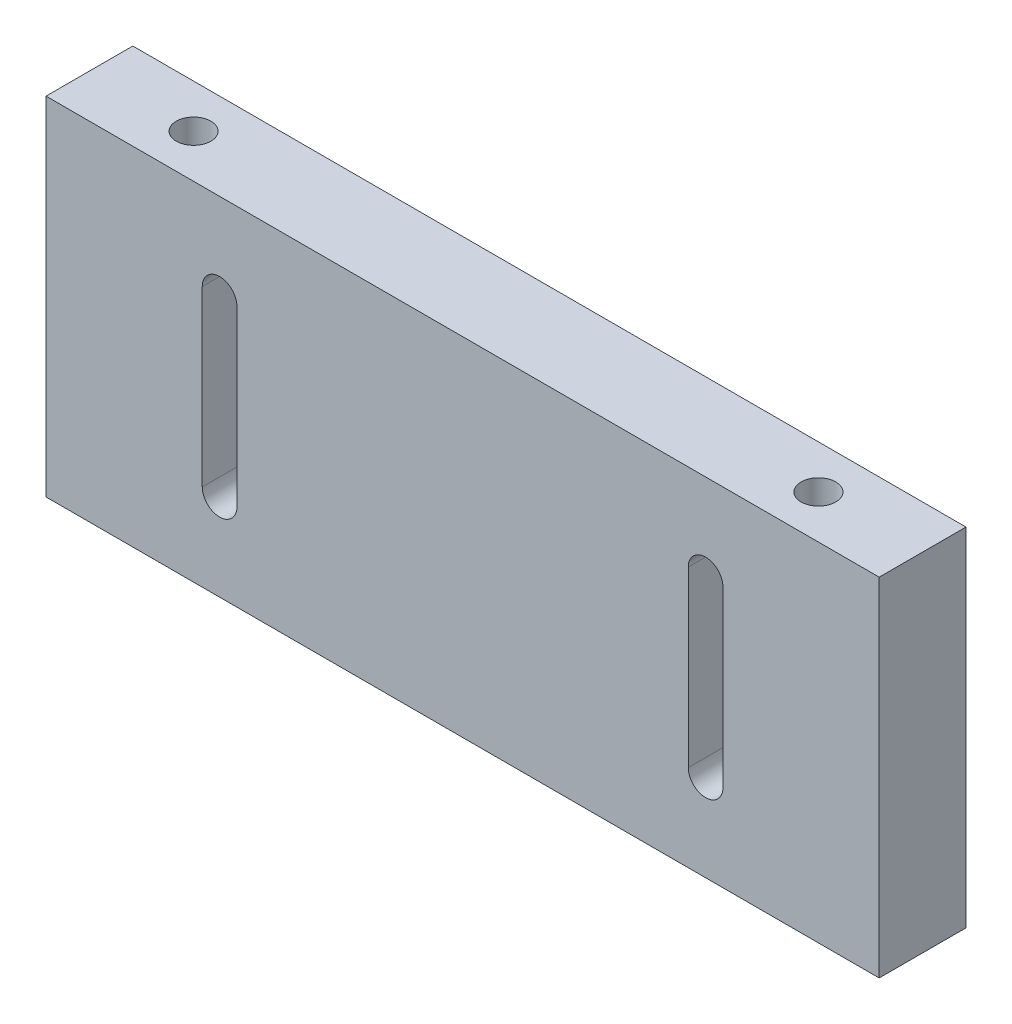
ISO-10303-21;
HEADER;
FILE_DESCRIPTION(('STEP AP214'),'2;1');
FILE_NAME('part.step','',(''),(''),'','','');
FILE_SCHEMA(('AUTOMOTIVE_DESIGN { 1 0 10303 214 1 1 1 1 }'));
ENDSEC;
DATA;
#1=APPLICATION_CONTEXT('core data for automotive mechanical design processes');
#2=APPLICATION_PROTOCOL_DEFINITION('international standard','automotive_design',2000,#1);
#3=PRODUCT_CONTEXT('',#1,'mechanical');
#4=PRODUCT('Part','Part','',(#3));
#5=PRODUCT_RELATED_PRODUCT_CATEGORY('part','',(#4));
#6=PRODUCT_DEFINITION_FORMATION('','',#4);
#7=PRODUCT_DEFINITION_CONTEXT('part definition',#1,'design');
#8=PRODUCT_DEFINITION('design','',#6,#7);
#9=PRODUCT_DEFINITION_SHAPE('','',#8);
#10=(LENGTH_UNIT() NAMED_UNIT(*) SI_UNIT(.MILLI.,.METRE.));
#11=(NAMED_UNIT(*) PLANE_ANGLE_UNIT() SI_UNIT($,.RADIAN.));
#12=(NAMED_UNIT(*) SI_UNIT($,.STERADIAN.) SOLID_ANGLE_UNIT());
#13=UNCERTAINTY_MEASURE_WITH_UNIT(LENGTH_MEASURE(1.E-05),#10,'distance_accuracy_value','');
#14=(GEOMETRIC_REPRESENTATION_CONTEXT(3) GLOBAL_UNCERTAINTY_ASSIGNED_CONTEXT((#13)) GLOBAL_UNIT_ASSIGNED_CONTEXT((#10,
#11,#12)) REPRESENTATION_CONTEXT('',''));
#15=CARTESIAN_POINT('',(0.,0.,0.));
#16=DIRECTION('',(0.,0.,1.));
#17=DIRECTION('',(1.,0.,0.));
#18=AXIS2_PLACEMENT_3D('',#15,#16,#17);
#19=CARTESIAN_POINT('',(-120.,-100.,-9.72222222222218));
#20=DIRECTION('',(-1.,0.,0.));
#21=DIRECTION('',(0.,0.,1.));
#22=AXIS2_PLACEMENT_3D('',#19,#20,#21);
#23=PLANE('',#22);
#24=DIRECTION('',(0.,0.,1.));
#25=VECTOR('',#24,1.);
#26=CARTESIAN_POINT('',(-120.,0.,-9.72222222222218));
#27=LINE('',#26,#25);
#28=CARTESIAN_POINT('',(-120.,0.,-9.72222222222218));
#29=VERTEX_POINT('',#28);
#30=CARTESIAN_POINT('',(-120.,0.,15.2777777777778));
#31=VERTEX_POINT('',#30);
#32=EDGE_CURVE('E212',#29,#31,#27,.T.);
#33=ORIENTED_EDGE('',*,*,#32,.F.);
#34=DIRECTION('',(0.,1.,0.));
#35=VECTOR('',#34,1.);
#36=CARTESIAN_POINT('',(-120.,-100.,-9.72222222222218));
#37=LINE('',#36,#35);
#38=CARTESIAN_POINT('',(-120.,-100.,-9.72222222222218));
#39=VERTEX_POINT('',#38);
#40=EDGE_CURVE('E13',#39,#29,#37,.T.);
#41=ORIENTED_EDGE('',*,*,#40,.F.);
#42=DIRECTION('',(0.,0.,1.));
#43=VECTOR('',#42,1.);
#44=CARTESIAN_POINT('',(-120.,-100.,-9.72222222222218));
#45=LINE('',#44,#43);
#46=CARTESIAN_POINT('',(-120.,-100.,15.2777777777778));
#47=VERTEX_POINT('',#46);
#48=EDGE_CURVE('E215',#39,#47,#45,.T.);
#49=ORIENTED_EDGE('',*,*,#48,.T.);
#50=DIRECTION('',(0.,1.,0.));
#51=VECTOR('',#50,1.);
#52=CARTESIAN_POINT('',(-120.,-100.,15.2777777777778));
#53=LINE('',#52,#51);
#54=EDGE_CURVE('E48',#47,#31,#53,.T.);
#55=ORIENTED_EDGE('',*,*,#54,.T.);
#56=EDGE_LOOP('',(#33,#41,#49,#55));
#57=FACE_BOUND('',#56,.T.);
#58=ADVANCED_FACE('F45',(#57),#23,.T.);
#59=CARTESIAN_POINT('',(-120.,-100.,-9.72222222222218));
#60=DIRECTION('',(0.,0.,-1.));
#61=DIRECTION('',(-1.,0.,0.));
#62=AXIS2_PLACEMENT_3D('',#59,#60,#61);
#63=PLANE('',#62);
#64=CARTESIAN_POINT('',(70.,-25.,-9.72222222222218));
#65=DIRECTION('',(0.,0.,1.));
#66=DIRECTION('',(1.,0.,0.));
#67=AXIS2_PLACEMENT_3D('',#64,#65,#66);
#68=CIRCLE('',#67,4.99999999999999);
#69=CARTESIAN_POINT('',(75.,-25.,-9.72222222222218));
#70=VERTEX_POINT('',#69);
#71=CARTESIAN_POINT('',(65.,-25.,-9.72222222222218));
#72=VERTEX_POINT('',#71);
#73=EDGE_CURVE('E136',#70,#72,#68,.T.);
#74=ORIENTED_EDGE('',*,*,#73,.T.);
#75=DIRECTION('',(0.,-1.,0.));
#76=VECTOR('',#75,1.);
#77=CARTESIAN_POINT('',(65.,-25.,-9.72222222222218));
#78=LINE('',#77,#76);
#79=CARTESIAN_POINT('',(65.,-75.,-9.72222222222218));
#80=VERTEX_POINT('',#79);
#81=EDGE_CURVE('E145',#72,#80,#78,.T.);
#82=ORIENTED_EDGE('',*,*,#81,.T.);
#83=CARTESIAN_POINT('',(70.,-75.,-9.72222222222218));
#84=DIRECTION('',(0.,0.,1.));
#85=DIRECTION('',(1.,0.,0.));
#86=AXIS2_PLACEMENT_3D('',#83,#84,#85);
#87=CIRCLE('',#86,4.99999999999998);
#88=CARTESIAN_POINT('',(75.,-75.,-9.72222222222218));
#89=VERTEX_POINT('',#88);
#90=EDGE_CURVE('E61',#80,#89,#87,.T.);
#91=ORIENTED_EDGE('',*,*,#90,.T.);
#92=DIRECTION('',(0.,1.,0.));
#93=VECTOR('',#92,1.);
#94=CARTESIAN_POINT('',(75.,-25.,-9.72222222222218));
#95=LINE('',#94,#93);
#96=EDGE_CURVE('E142',#89,#70,#95,.T.);
#97=ORIENTED_EDGE('',*,*,#96,.T.);
#98=EDGE_LOOP('',(#74,#82,#91,#97));
#99=FACE_BOUND('',#98,.T.);
#100=CARTESIAN_POINT('',(-70.,-25.,-9.72222222222218));
#101=DIRECTION('',(0.,0.,1.));
#102=DIRECTION('',(1.,0.,0.));
#103=AXIS2_PLACEMENT_3D('',#100,#101,#102);
#104=CIRCLE('',#103,5.);
#105=CARTESIAN_POINT('',(-65.,-25.,-9.72222222222218));
#106=VERTEX_POINT('',#105);
#107=CARTESIAN_POINT('',(-75.,-25.,-9.72222222222218));
#108=VERTEX_POINT('',#107);
#109=EDGE_CURVE('E171',#106,#108,#104,.T.);
#110=ORIENTED_EDGE('',*,*,#109,.T.);
#111=DIRECTION('',(0.,-1.,0.));
#112=VECTOR('',#111,1.);
#113=CARTESIAN_POINT('',(-75.,-25.,-9.72222222222218));
#114=LINE('',#113,#112);
#115=CARTESIAN_POINT('',(-75.,-75.,-9.72222222222218));
#116=VERTEX_POINT('',#115);
#117=EDGE_CURVE('E174',#108,#116,#114,.T.);
#118=ORIENTED_EDGE('',*,*,#117,.T.);
#119=CARTESIAN_POINT('',(-70.,-75.,-9.72222222222218));
#120=DIRECTION('',(0.,0.,1.));
#121=DIRECTION('',(1.,0.,0.));
#122=AXIS2_PLACEMENT_3D('',#119,#120,#121);
#123=CIRCLE('',#122,4.99999999999999);
#124=CARTESIAN_POINT('',(-65.,-75.,-9.72222222222218));
#125=VERTEX_POINT('',#124);
#126=EDGE_CURVE('E178',#116,#125,#123,.T.);
#127=ORIENTED_EDGE('',*,*,#126,.T.);
#128=DIRECTION('',(0.,1.,0.));
#129=VECTOR('',#128,1.);
#130=CARTESIAN_POINT('',(-65.,-25.,-9.72222222222218));
#131=LINE('',#130,#129);
#132=EDGE_CURVE('E181',#125,#106,#131,.T.);
#133=ORIENTED_EDGE('',*,*,#132,.T.);
#134=EDGE_LOOP('',(#110,#118,#127,#133));
#135=FACE_BOUND('',#134,.T.);
#136=DIRECTION('',(-1.,0.,0.));
#137=VECTOR('',#136,1.);
#138=CARTESIAN_POINT('',(-120.,0.,-9.72222222222218));
#139=LINE('',#138,#137);
#140=CARTESIAN_POINT('',(120.,0.,-9.72222222222218));
#141=VERTEX_POINT('',#140);
#142=EDGE_CURVE('E219',#141,#29,#139,.T.);
#143=ORIENTED_EDGE('',*,*,#142,.F.);
#144=DIRECTION('',(0.,1.,0.));
#145=VECTOR('',#144,1.);
#146=CARTESIAN_POINT('',(120.,-100.,-9.72222222222218));
#147=LINE('',#146,#145);
#148=CARTESIAN_POINT('',(120.,-100.,-9.72222222222218));
#149=VERTEX_POINT('',#148);
#150=EDGE_CURVE('E53',#149,#141,#147,.T.);
#151=ORIENTED_EDGE('',*,*,#150,.F.);
#152=DIRECTION('',(-1.,0.,0.));
#153=VECTOR('',#152,1.);
#154=CARTESIAN_POINT('',(-120.,-100.,-9.72222222222218));
#155=LINE('',#154,#153);
#156=EDGE_CURVE('E225',#149,#39,#155,.T.);
#157=ORIENTED_EDGE('',*,*,#156,.T.);
#158=ORIENTED_EDGE('',*,*,#40,.T.);
#159=EDGE_LOOP('',(#143,#151,#157,#158));
#160=FACE_BOUND('',#159,.T.);
#161=ADVANCED_FACE('F149',(#99,#135,#160),#63,.T.);
#162=CARTESIAN_POINT('',(120.,-100.,-9.72222222222218));
#163=DIRECTION('',(1.,0.,0.));
#164=DIRECTION('',(0.,0.,-1.));
#165=AXIS2_PLACEMENT_3D('',#162,#163,#164);
#166=PLANE('',#165);
#167=DIRECTION('',(0.,0.,-1.));
#168=VECTOR('',#167,1.);
#169=CARTESIAN_POINT('',(120.,0.,-9.72222222222218));
#170=LINE('',#169,#168);
#171=CARTESIAN_POINT('',(120.,0.,15.2777777777778));
#172=VERTEX_POINT('',#171);
#173=EDGE_CURVE('E233',#172,#141,#170,.T.);
#174=ORIENTED_EDGE('',*,*,#173,.F.);
#175=DIRECTION('',(0.,1.,0.));
#176=VECTOR('',#175,1.);
#177=CARTESIAN_POINT('',(120.,-100.,15.2777777777778));
#178=LINE('',#177,#176);
#179=CARTESIAN_POINT('',(120.,-100.,15.2777777777778));
#180=VERTEX_POINT('',#179);
#181=EDGE_CURVE('E238',#180,#172,#178,.T.);
#182=ORIENTED_EDGE('',*,*,#181,.F.);
#183=DIRECTION('',(0.,0.,-1.));
#184=VECTOR('',#183,1.);
#185=CARTESIAN_POINT('',(120.,-100.,-9.72222222222218));
#186=LINE('',#185,#184);
#187=EDGE_CURVE('E222',#180,#149,#186,.T.);
#188=ORIENTED_EDGE('',*,*,#187,.T.);
#189=ORIENTED_EDGE('',*,*,#150,.T.);
#190=EDGE_LOOP('',(#174,#182,#188,#189));
#191=FACE_BOUND('',#190,.T.);
#192=ADVANCED_FACE('F256',(#191),#166,.T.);
#193=CARTESIAN_POINT('',(-120.,-100.,15.2777777777778));
#194=DIRECTION('',(0.,0.,1.));
#195=DIRECTION('',(1.,0.,0.));
#196=AXIS2_PLACEMENT_3D('',#193,#194,#195);
#197=PLANE('',#196);
#198=CARTESIAN_POINT('',(70.,-25.,15.2777777777778));
#199=DIRECTION('',(0.,0.,1.));
#200=DIRECTION('',(1.,0.,0.));
#201=AXIS2_PLACEMENT_3D('',#198,#199,#200);
#202=CIRCLE('',#201,4.99999999999999);
#203=CARTESIAN_POINT('',(75.,-25.,15.2777777777778));
#204=VERTEX_POINT('',#203);
#205=CARTESIAN_POINT('',(65.,-25.,15.2777777777778));
#206=VERTEX_POINT('',#205);
#207=EDGE_CURVE('E69',#204,#206,#202,.T.);
#208=ORIENTED_EDGE('',*,*,#207,.F.);
#209=DIRECTION('',(0.,1.,0.));
#210=VECTOR('',#209,1.);
#211=CARTESIAN_POINT('',(75.,-25.,15.2777777777778));
#212=LINE('',#211,#210);
#213=CARTESIAN_POINT('',(75.,-75.,15.2777777777778));
#214=VERTEX_POINT('',#213);
#215=EDGE_CURVE('E152',#214,#204,#212,.T.);
#216=ORIENTED_EDGE('',*,*,#215,.F.);
#217=CARTESIAN_POINT('',(70.,-75.,15.2777777777778));
#218=DIRECTION('',(0.,0.,1.));
#219=DIRECTION('',(1.,0.,0.));
#220=AXIS2_PLACEMENT_3D('',#217,#218,#219);
#221=CIRCLE('',#220,4.99999999999998);
#222=CARTESIAN_POINT('',(65.,-75.,15.2777777777778));
#223=VERTEX_POINT('',#222);
#224=EDGE_CURVE('E155',#223,#214,#221,.T.);
#225=ORIENTED_EDGE('',*,*,#224,.F.);
#226=DIRECTION('',(0.,-1.,0.));
#227=VECTOR('',#226,1.);
#228=CARTESIAN_POINT('',(65.,-25.,15.2777777777778));
#229=LINE('',#228,#227);
#230=EDGE_CURVE('E161',#206,#223,#229,.T.);
#231=ORIENTED_EDGE('',*,*,#230,.F.);
#232=EDGE_LOOP('',(#208,#216,#225,#231));
#233=FACE_BOUND('',#232,.T.);
#234=CARTESIAN_POINT('',(-70.,-25.,15.2777777777778));
#235=DIRECTION('',(0.,0.,1.));
#236=DIRECTION('',(1.,0.,0.));
#237=AXIS2_PLACEMENT_3D('',#234,#235,#236);
#238=CIRCLE('',#237,5.);
#239=CARTESIAN_POINT('',(-65.,-25.,15.2777777777778));
#240=VERTEX_POINT('',#239);
#241=CARTESIAN_POINT('',(-75.,-25.,15.2777777777778));
#242=VERTEX_POINT('',#241);
#243=EDGE_CURVE('E167',#240,#242,#238,.T.);
#244=ORIENTED_EDGE('',*,*,#243,.F.);
#245=DIRECTION('',(0.,1.,0.));
#246=VECTOR('',#245,1.);
#247=CARTESIAN_POINT('',(-65.,-25.,15.2777777777778));
#248=LINE('',#247,#246);
#249=CARTESIAN_POINT('',(-65.,-75.,15.2777777777778));
#250=VERTEX_POINT('',#249);
#251=EDGE_CURVE('E175',#250,#240,#248,.T.);
#252=ORIENTED_EDGE('',*,*,#251,.F.);
#253=CARTESIAN_POINT('',(-70.,-75.,15.2777777777778));
#254=DIRECTION('',(0.,0.,1.));
#255=DIRECTION('',(1.,0.,0.));
#256=AXIS2_PLACEMENT_3D('',#253,#254,#255);
#257=CIRCLE('',#256,4.99999999999999);
#258=CARTESIAN_POINT('',(-75.,-75.,15.2777777777778));
#259=VERTEX_POINT('',#258);
#260=EDGE_CURVE('E189',#259,#250,#257,.T.);
#261=ORIENTED_EDGE('',*,*,#260,.F.);
#262=DIRECTION('',(0.,-1.,0.));
#263=VECTOR('',#262,1.);
#264=CARTESIAN_POINT('',(-75.,-25.,15.2777777777778));
#265=LINE('',#264,#263);
#266=EDGE_CURVE('E186',#242,#259,#265,.T.);
#267=ORIENTED_EDGE('',*,*,#266,.F.);
#268=EDGE_LOOP('',(#244,#252,#261,#267));
#269=FACE_BOUND('',#268,.T.);
#270=DIRECTION('',(1.,0.,0.));
#271=VECTOR('',#270,1.);
#272=CARTESIAN_POINT('',(-120.,0.,15.2777777777778));
#273=LINE('',#272,#271);
#274=EDGE_CURVE('E230',#31,#172,#273,.T.);
#275=ORIENTED_EDGE('',*,*,#274,.F.);
#276=ORIENTED_EDGE('',*,*,#54,.F.);
#277=DIRECTION('',(1.,0.,0.));
#278=VECTOR('',#277,1.);
#279=CARTESIAN_POINT('',(-120.,-100.,15.2777777777778));
#280=LINE('',#279,#278);
#281=EDGE_CURVE('E218',#47,#180,#280,.T.);
#282=ORIENTED_EDGE('',*,*,#281,.T.);
#283=ORIENTED_EDGE('',*,*,#181,.T.);
#284=EDGE_LOOP('',(#275,#276,#282,#283));
#285=FACE_BOUND('',#284,.T.);
#286=ADVANCED_FACE('F246',(#233,#269,#285),#197,.T.);
#287=CARTESIAN_POINT('',(0.,-100.,0.));
#288=DIRECTION('',(0.,1.,0.));
#289=DIRECTION('',(0.,0.,1.));
#290=AXIS2_PLACEMENT_3D('',#287,#288,#289);
#291=PLANE('',#290);
#292=ORIENTED_EDGE('',*,*,#48,.F.);
#293=ORIENTED_EDGE('',*,*,#156,.F.);
#294=ORIENTED_EDGE('',*,*,#187,.F.);
#295=ORIENTED_EDGE('',*,*,#281,.F.);
#296=EDGE_LOOP('',(#292,#293,#294,#295));
#297=FACE_BOUND('',#296,.T.);
#298=ADVANCED_FACE('F253',(#297),#291,.F.);
#299=CARTESIAN_POINT('',(0.,0.,0.));
#300=DIRECTION('',(0.,1.,0.));
#301=DIRECTION('',(0.,0.,1.));
#302=AXIS2_PLACEMENT_3D('',#299,#300,#301);
#303=PLANE('',#302);
#304=CARTESIAN_POINT('',(90.,0.,2.77777777777782));
#305=DIRECTION('',(0.,1.,0.));
#306=DIRECTION('',(0.,0.,1.));
#307=AXIS2_PLACEMENT_3D('',#304,#305,#306);
#308=CIRCLE('',#307,5.);
#309=CARTESIAN_POINT('',(90.,0.,7.77777777777782));
#310=VERTEX_POINT('',#309);
#311=EDGE_CURVE('E196',#310,#310,#308,.T.);
#312=ORIENTED_EDGE('',*,*,#311,.F.);
#313=EDGE_LOOP('',(#312));
#314=FACE_BOUND('',#313,.T.);
#315=CARTESIAN_POINT('',(-90.,0.,2.77777777777782));
#316=DIRECTION('',(0.,1.,0.));
#317=DIRECTION('',(0.,0.,1.));
#318=AXIS2_PLACEMENT_3D('',#315,#316,#317);
#319=CIRCLE('',#318,5.);
#320=CARTESIAN_POINT('',(-90.,0.,7.77777777777782));
#321=VERTEX_POINT('',#320);
#322=EDGE_CURVE('E206',#321,#321,#319,.T.);
#323=ORIENTED_EDGE('',*,*,#322,.F.);
#324=EDGE_LOOP('',(#323));
#325=FACE_BOUND('',#324,.T.);
#326=ORIENTED_EDGE('',*,*,#32,.T.);
#327=ORIENTED_EDGE('',*,*,#274,.T.);
#328=ORIENTED_EDGE('',*,*,#173,.T.);
#329=ORIENTED_EDGE('',*,*,#142,.T.);
#330=EDGE_LOOP('',(#326,#327,#328,#329));
#331=FACE_BOUND('',#330,.T.);
#332=ADVANCED_FACE('F248',(#314,#325,#331),#303,.T.);
#333=CARTESIAN_POINT('',(-90.,-25.,2.77777777777782));
#334=DIRECTION('',(0.,1.,0.));
#335=DIRECTION('',(0.,0.,1.));
#336=AXIS2_PLACEMENT_3D('',#333,#334,#335);
#337=CYLINDRICAL_SURFACE('',#336,5.);
#338=CARTESIAN_POINT('',(-90.,-25.,2.77777777777782));
#339=DIRECTION('',(0.,1.,0.));
#340=DIRECTION('',(0.,0.,1.));
#341=AXIS2_PLACEMENT_3D('',#338,#339,#340);
#342=CIRCLE('',#341,5.);
#343=CARTESIAN_POINT('',(-90.,-25.,7.77777777777782));
#344=VERTEX_POINT('',#343);
#345=EDGE_CURVE('E209',#344,#344,#342,.T.);
#346=ORIENTED_EDGE('',*,*,#345,.F.);
#347=EDGE_LOOP('',(#346));
#348=FACE_BOUND('',#347,.T.);
#349=ORIENTED_EDGE('',*,*,#322,.T.);
#350=EDGE_LOOP('',(#349));
#351=FACE_BOUND('',#350,.T.);
#352=ADVANCED_FACE('F376',(#348,#351),#337,.F.);
#353=CARTESIAN_POINT('',(-90.,-25.,2.77777777777782));
#354=DIRECTION('',(0.,1.,0.));
#355=DIRECTION('',(0.,0.,1.));
#356=AXIS2_PLACEMENT_3D('',#353,#354,#355);
#357=PLANE('',#356);
#358=ORIENTED_EDGE('',*,*,#345,.T.);
#359=EDGE_LOOP('',(#358));
#360=FACE_BOUND('',#359,.T.);
#361=ADVANCED_FACE('F372',(#360),#357,.T.);
#362=CARTESIAN_POINT('',(90.,-25.,2.77777777777782));
#363=DIRECTION('',(0.,1.,0.));
#364=DIRECTION('',(0.,0.,1.));
#365=AXIS2_PLACEMENT_3D('',#362,#363,#364);
#366=CYLINDRICAL_SURFACE('',#365,5.);
#367=CARTESIAN_POINT('',(90.,-25.,2.77777777777782));
#368=DIRECTION('',(0.,1.,0.));
#369=DIRECTION('',(0.,0.,1.));
#370=AXIS2_PLACEMENT_3D('',#367,#368,#369);
#371=CIRCLE('',#370,5.);
#372=CARTESIAN_POINT('',(90.,-25.,7.77777777777782));
#373=VERTEX_POINT('',#372);
#374=EDGE_CURVE('E203',#373,#373,#371,.T.);
#375=ORIENTED_EDGE('',*,*,#374,.F.);
#376=EDGE_LOOP('',(#375));
#377=FACE_BOUND('',#376,.T.);
#378=ORIENTED_EDGE('',*,*,#311,.T.);
#379=EDGE_LOOP('',(#378));
#380=FACE_BOUND('',#379,.T.);
#381=ADVANCED_FACE('F368',(#377,#380),#366,.F.);
#382=CARTESIAN_POINT('',(90.,-25.,2.77777777777782));
#383=DIRECTION('',(0.,1.,0.));
#384=DIRECTION('',(0.,0.,1.));
#385=AXIS2_PLACEMENT_3D('',#382,#383,#384);
#386=PLANE('',#385);
#387=ORIENTED_EDGE('',*,*,#374,.T.);
#388=EDGE_LOOP('',(#387));
#389=FACE_BOUND('',#388,.T.);
#390=ADVANCED_FACE('F279',(#389),#386,.T.);
#391=CARTESIAN_POINT('',(-70.,-25.,-9.72222222222218));
#392=DIRECTION('',(0.,0.,1.));
#393=DIRECTION('',(1.,0.,0.));
#394=AXIS2_PLACEMENT_3D('',#391,#392,#393);
#395=CYLINDRICAL_SURFACE('',#394,5.);
#396=ORIENTED_EDGE('',*,*,#243,.T.);
#397=DIRECTION('',(0.,0.,1.));
#398=VECTOR('',#397,1.);
#399=CARTESIAN_POINT('',(-75.,-25.,-9.72222222222218));
#400=LINE('',#399,#398);
#401=EDGE_CURVE('E184',#108,#242,#400,.T.);
#402=ORIENTED_EDGE('',*,*,#401,.F.);
#403=ORIENTED_EDGE('',*,*,#109,.F.);
#404=DIRECTION('',(0.,0.,1.));
#405=VECTOR('',#404,1.);
#406=CARTESIAN_POINT('',(-65.,-25.,-9.72222222222218));
#407=LINE('',#406,#405);
#408=EDGE_CURVE('E194',#106,#240,#407,.T.);
#409=ORIENTED_EDGE('',*,*,#408,.T.);
#410=EDGE_LOOP('',(#396,#402,#403,#409));
#411=FACE_BOUND('',#410,.T.);
#412=ADVANCED_FACE('F292',(#411),#395,.F.);
#413=CARTESIAN_POINT('',(-65.,-25.,-9.72222222222218));
#414=DIRECTION('',(1.,0.,0.));
#415=DIRECTION('',(0.,0.,-1.));
#416=AXIS2_PLACEMENT_3D('',#413,#414,#415);
#417=PLANE('',#416);
#418=ORIENTED_EDGE('',*,*,#251,.T.);
#419=ORIENTED_EDGE('',*,*,#408,.F.);
#420=ORIENTED_EDGE('',*,*,#132,.F.);
#421=DIRECTION('',(0.,0.,1.));
#422=VECTOR('',#421,1.);
#423=CARTESIAN_POINT('',(-65.,-75.,-9.72222222222218));
#424=LINE('',#423,#422);
#425=EDGE_CURVE('E197',#125,#250,#424,.T.);
#426=ORIENTED_EDGE('',*,*,#425,.T.);
#427=EDGE_LOOP('',(#418,#419,#420,#426));
#428=FACE_BOUND('',#427,.T.);
#429=ADVANCED_FACE('F297',(#428),#417,.F.);
#430=CARTESIAN_POINT('',(-70.,-75.,-9.72222222222218));
#431=DIRECTION('',(0.,0.,1.));
#432=DIRECTION('',(1.,0.,0.));
#433=AXIS2_PLACEMENT_3D('',#430,#431,#432);
#434=CYLINDRICAL_SURFACE('',#433,4.99999999999999);
#435=ORIENTED_EDGE('',*,*,#260,.T.);
#436=ORIENTED_EDGE('',*,*,#425,.F.);
#437=ORIENTED_EDGE('',*,*,#126,.F.);
#438=DIRECTION('',(0.,0.,1.));
#439=VECTOR('',#438,1.);
#440=CARTESIAN_POINT('',(-75.,-75.,-9.72222222222218));
#441=LINE('',#440,#439);
#442=EDGE_CURVE('E199',#116,#259,#441,.T.);
#443=ORIENTED_EDGE('',*,*,#442,.T.);
#444=EDGE_LOOP('',(#435,#436,#437,#443));
#445=FACE_BOUND('',#444,.T.);
#446=ADVANCED_FACE('F307',(#445),#434,.F.);
#447=CARTESIAN_POINT('',(-75.,-25.,-9.72222222222218));
#448=DIRECTION('',(-1.,0.,0.));
#449=DIRECTION('',(0.,-1.,0.));
#450=AXIS2_PLACEMENT_3D('',#447,#448,#449);
#451=PLANE('',#450);
#452=ORIENTED_EDGE('',*,*,#266,.T.);
#453=ORIENTED_EDGE('',*,*,#442,.F.);
#454=ORIENTED_EDGE('',*,*,#117,.F.);
#455=ORIENTED_EDGE('',*,*,#401,.T.);
#456=EDGE_LOOP('',(#452,#453,#454,#455));
#457=FACE_BOUND('',#456,.T.);
#458=ADVANCED_FACE('F317',(#457),#451,.F.);
#459=CARTESIAN_POINT('',(70.,-25.,-9.72222222222218));
#460=DIRECTION('',(0.,0.,1.));
#461=DIRECTION('',(1.,0.,0.));
#462=AXIS2_PLACEMENT_3D('',#459,#460,#461);
#463=CYLINDRICAL_SURFACE('',#462,4.99999999999999);
#464=ORIENTED_EDGE('',*,*,#207,.T.);
#465=DIRECTION('',(0.,0.,1.));
#466=VECTOR('',#465,1.);
#467=CARTESIAN_POINT('',(65.,-25.,-9.72222222222218));
#468=LINE('',#467,#466);
#469=EDGE_CURVE('E132',#72,#206,#468,.T.);
#470=ORIENTED_EDGE('',*,*,#469,.F.);
#471=ORIENTED_EDGE('',*,*,#73,.F.);
#472=DIRECTION('',(0.,0.,1.));
#473=VECTOR('',#472,1.);
#474=CARTESIAN_POINT('',(75.,-25.,-9.72222222222218));
#475=LINE('',#474,#473);
#476=EDGE_CURVE('E165',#70,#204,#475,.T.);
#477=ORIENTED_EDGE('',*,*,#476,.T.);
#478=EDGE_LOOP('',(#464,#470,#471,#477));
#479=FACE_BOUND('',#478,.T.);
#480=ADVANCED_FACE('F134',(#479),#463,.F.);
#481=CARTESIAN_POINT('',(75.,-25.,-9.72222222222218));
#482=DIRECTION('',(1.,0.,0.));
#483=DIRECTION('',(0.,0.,-1.));
#484=AXIS2_PLACEMENT_3D('',#481,#482,#483);
#485=PLANE('',#484);
#486=ORIENTED_EDGE('',*,*,#215,.T.);
#487=ORIENTED_EDGE('',*,*,#476,.F.);
#488=ORIENTED_EDGE('',*,*,#96,.F.);
#489=DIRECTION('',(0.,0.,1.));
#490=VECTOR('',#489,1.);
#491=CARTESIAN_POINT('',(75.,-75.,-9.72222222222218));
#492=LINE('',#491,#490);
#493=EDGE_CURVE('E168',#89,#214,#492,.T.);
#494=ORIENTED_EDGE('',*,*,#493,.T.);
#495=EDGE_LOOP('',(#486,#487,#488,#494));
#496=FACE_BOUND('',#495,.T.);
#497=ADVANCED_FACE('F336',(#496),#485,.F.);
#498=CARTESIAN_POINT('',(70.,-75.,-9.72222222222218));
#499=DIRECTION('',(0.,0.,1.));
#500=DIRECTION('',(1.,0.,0.));
#501=AXIS2_PLACEMENT_3D('',#498,#499,#500);
#502=CYLINDRICAL_SURFACE('',#501,4.99999999999998);
#503=ORIENTED_EDGE('',*,*,#224,.T.);
#504=ORIENTED_EDGE('',*,*,#493,.F.);
#505=ORIENTED_EDGE('',*,*,#90,.F.);
#506=DIRECTION('',(0.,0.,1.));
#507=VECTOR('',#506,1.);
#508=CARTESIAN_POINT('',(65.,-75.,-9.72222222222218));
#509=LINE('',#508,#507);
#510=EDGE_CURVE('E141',#80,#223,#509,.T.);
#511=ORIENTED_EDGE('',*,*,#510,.T.);
#512=EDGE_LOOP('',(#503,#504,#505,#511));
#513=FACE_BOUND('',#512,.T.);
#514=ADVANCED_FACE('F345',(#513),#502,.F.);
#515=CARTESIAN_POINT('',(65.,-25.,-9.72222222222218));
#516=DIRECTION('',(-1.,0.,0.));
#517=DIRECTION('',(0.,-1.,0.));
#518=AXIS2_PLACEMENT_3D('',#515,#516,#517);
#519=PLANE('',#518);
#520=ORIENTED_EDGE('',*,*,#230,.T.);
#521=ORIENTED_EDGE('',*,*,#510,.F.);
#522=ORIENTED_EDGE('',*,*,#81,.F.);
#523=ORIENTED_EDGE('',*,*,#469,.T.);
#524=EDGE_LOOP('',(#520,#521,#522,#523));
#525=FACE_BOUND('',#524,.T.);
#526=ADVANCED_FACE('F146',(#525),#519,.F.);
#527=CLOSED_SHELL('',(#58,#161,#192,#286,#298,#332,#352,#361,#381,#390,#412,#429,#446,#458,#480,
#497,#514,#526));
#528=MANIFOLD_SOLID_BREP('B2',#527);
#529=ADVANCED_BREP_SHAPE_REPRESENTATION('',(#18,#528),#14);
#530=SHAPE_DEFINITION_REPRESENTATION(#9,#529);
ENDSEC;
END-ISO-10303-21;
